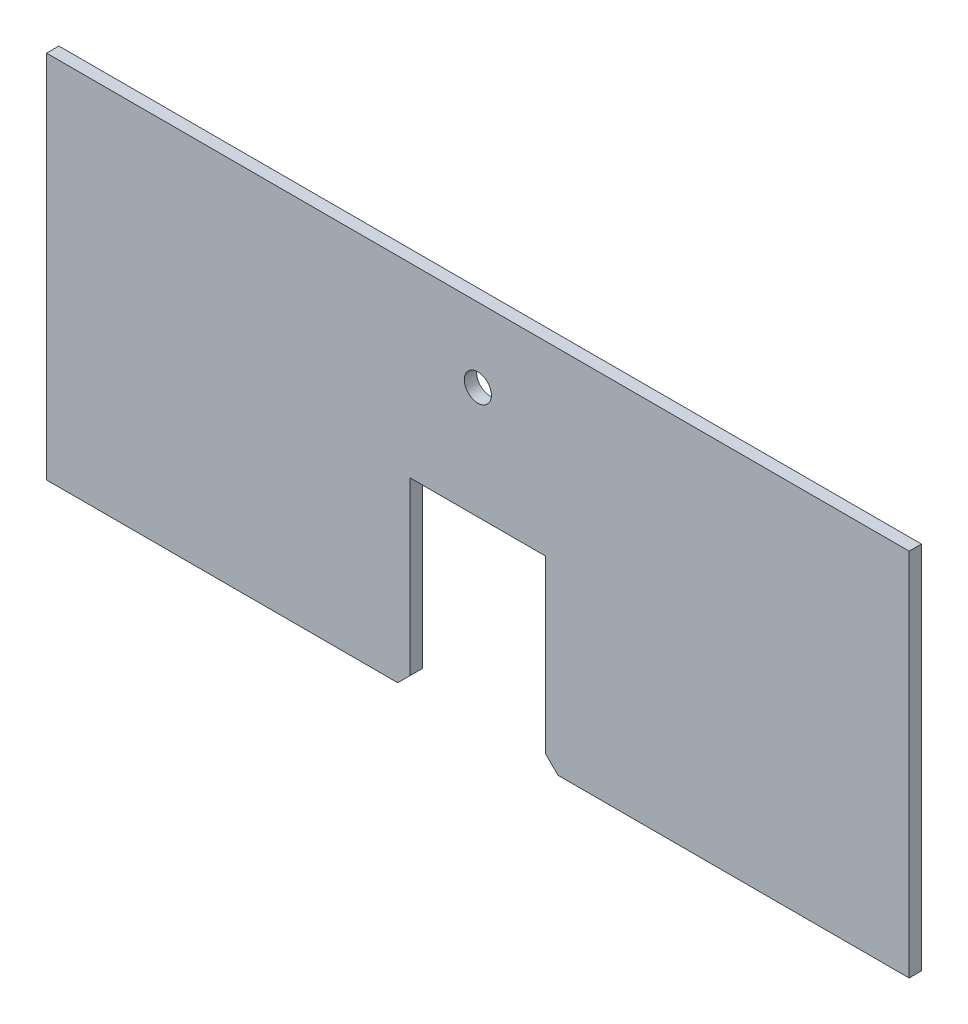
ISO-10303-21;
HEADER;
FILE_DESCRIPTION(('STEP AP214'),'2;1');
FILE_NAME('part.step','',(''),(''),'','','');
FILE_SCHEMA(('AUTOMOTIVE_DESIGN { 1 0 10303 214 1 1 1 1 }'));
ENDSEC;
DATA;
#1=APPLICATION_CONTEXT('core data for automotive mechanical design processes');
#2=APPLICATION_PROTOCOL_DEFINITION('international standard','automotive_design',2000,#1);
#3=PRODUCT_CONTEXT('',#1,'mechanical');
#4=PRODUCT('Part','Part','',(#3));
#5=PRODUCT_RELATED_PRODUCT_CATEGORY('part','',(#4));
#6=PRODUCT_DEFINITION_FORMATION('','',#4);
#7=PRODUCT_DEFINITION_CONTEXT('part definition',#1,'design');
#8=PRODUCT_DEFINITION('design','',#6,#7);
#9=PRODUCT_DEFINITION_SHAPE('','',#8);
#10=(LENGTH_UNIT() NAMED_UNIT(*) SI_UNIT(.MILLI.,.METRE.));
#11=(NAMED_UNIT(*) PLANE_ANGLE_UNIT() SI_UNIT($,.RADIAN.));
#12=(NAMED_UNIT(*) SI_UNIT($,.STERADIAN.) SOLID_ANGLE_UNIT());
#13=UNCERTAINTY_MEASURE_WITH_UNIT(LENGTH_MEASURE(1.E-05),#10,'distance_accuracy_value','');
#14=(GEOMETRIC_REPRESENTATION_CONTEXT(3) GLOBAL_UNCERTAINTY_ASSIGNED_CONTEXT((#13)) GLOBAL_UNIT_ASSIGNED_CONTEXT((#10,
#11,#12)) REPRESENTATION_CONTEXT('',''));
#15=CARTESIAN_POINT('',(0.,0.,0.));
#16=DIRECTION('',(0.,0.,1.));
#17=DIRECTION('',(1.,0.,0.));
#18=AXIS2_PLACEMENT_3D('',#15,#16,#17);
#19=CARTESIAN_POINT('',(-350.,232.421392473446,5.));
#20=DIRECTION('',(1.,0.,0.));
#21=DIRECTION('',(0.,1.,0.));
#22=AXIS2_PLACEMENT_3D('',#19,#20,#21);
#23=PLANE('',#22);
#24=DIRECTION('',(0.,-1.,0.));
#25=VECTOR('',#24,1.);
#26=CARTESIAN_POINT('',(-350.,232.421392473446,-5.));
#27=LINE('',#26,#25);
#28=CARTESIAN_POINT('',(-350.,232.421392473446,-5.));
#29=VERTEX_POINT('',#28);
#30=CARTESIAN_POINT('',(-350.,-67.5786075265541,-5.));
#31=VERTEX_POINT('',#30);
#32=EDGE_CURVE('E141',#29,#31,#27,.T.);
#33=ORIENTED_EDGE('',*,*,#32,.T.);
#34=DIRECTION('',(0.,0.,-1.));
#35=VECTOR('',#34,1.);
#36=CARTESIAN_POINT('',(-350.,-67.5786075265541,5.));
#37=LINE('',#36,#35);
#38=CARTESIAN_POINT('',(-350.,-67.5786075265541,5.));
#39=VERTEX_POINT('',#38);
#40=EDGE_CURVE('E11',#39,#31,#37,.T.);
#41=ORIENTED_EDGE('',*,*,#40,.F.);
#42=DIRECTION('',(0.,-1.,0.));
#43=VECTOR('',#42,1.);
#44=CARTESIAN_POINT('',(-350.,232.421392473446,5.));
#45=LINE('',#44,#43);
#46=CARTESIAN_POINT('',(-350.,232.421392473446,5.));
#47=VERTEX_POINT('',#46);
#48=EDGE_CURVE('E160',#47,#39,#45,.T.);
#49=ORIENTED_EDGE('',*,*,#48,.F.);
#50=DIRECTION('',(0.,0.,-1.));
#51=VECTOR('',#50,1.);
#52=CARTESIAN_POINT('',(-350.,232.421392473446,5.));
#53=LINE('',#52,#51);
#54=EDGE_CURVE('E137',#47,#29,#53,.T.);
#55=ORIENTED_EDGE('',*,*,#54,.T.);
#56=EDGE_LOOP('',(#33,#41,#49,#55));
#57=FACE_BOUND('',#56,.T.);
#58=ADVANCED_FACE('F33',(#57),#23,.F.);
#59=CARTESIAN_POINT('',(-350.,-67.5786075265541,5.));
#60=DIRECTION('',(0.,1.,0.));
#61=DIRECTION('',(-1.,0.,0.));
#62=AXIS2_PLACEMENT_3D('',#59,#60,#61);
#63=PLANE('',#62);
#64=DIRECTION('',(1.,0.,0.));
#65=VECTOR('',#64,1.);
#66=CARTESIAN_POINT('',(-350.,-67.5786075265541,-5.));
#67=LINE('',#66,#65);
#68=CARTESIAN_POINT('',(-65.,-67.5786075265541,-5.));
#69=VERTEX_POINT('',#68);
#70=EDGE_CURVE('E144',#31,#69,#67,.T.);
#71=ORIENTED_EDGE('',*,*,#70,.T.);
#72=DIRECTION('',(0.,0.,-1.));
#73=VECTOR('',#72,1.);
#74=CARTESIAN_POINT('',(-65.,-67.5786075265541,5.));
#75=LINE('',#74,#73);
#76=CARTESIAN_POINT('',(-65.,-67.5786075265541,5.));
#77=VERTEX_POINT('',#76);
#78=EDGE_CURVE('E41',#77,#69,#75,.T.);
#79=ORIENTED_EDGE('',*,*,#78,.F.);
#80=DIRECTION('',(1.,0.,0.));
#81=VECTOR('',#80,1.);
#82=CARTESIAN_POINT('',(-350.,-67.5786075265541,5.));
#83=LINE('',#82,#81);
#84=EDGE_CURVE('E98',#39,#77,#83,.T.);
#85=ORIENTED_EDGE('',*,*,#84,.F.);
#86=ORIENTED_EDGE('',*,*,#40,.T.);
#87=EDGE_LOOP('',(#71,#79,#85,#86));
#88=FACE_BOUND('',#87,.T.);
#89=ADVANCED_FACE('F227',(#88),#63,.F.);
#90=CARTESIAN_POINT('',(-65.,-67.5786075265541,5.));
#91=DIRECTION('',(-0.707106781186546,0.707106781186549,0.));
#92=DIRECTION('',(-0.707106781186549,-0.707106781186546,0.));
#93=AXIS2_PLACEMENT_3D('',#90,#91,#92);
#94=PLANE('',#93);
#95=DIRECTION('',(0.707106781186549,0.707106781186546,0.));
#96=VECTOR('',#95,1.);
#97=CARTESIAN_POINT('',(-65.,-67.5786075265541,-5.));
#98=LINE('',#97,#96);
#99=CARTESIAN_POINT('',(-55.,-57.5786075265541,-5.));
#100=VERTEX_POINT('',#99);
#101=EDGE_CURVE('E147',#69,#100,#98,.T.);
#102=ORIENTED_EDGE('',*,*,#101,.T.);
#103=DIRECTION('',(0.,0.,-1.));
#104=VECTOR('',#103,1.);
#105=CARTESIAN_POINT('',(-55.,-57.5786075265541,5.));
#106=LINE('',#105,#104);
#107=CARTESIAN_POINT('',(-55.,-57.5786075265541,5.));
#108=VERTEX_POINT('',#107);
#109=EDGE_CURVE('E173',#108,#100,#106,.T.);
#110=ORIENTED_EDGE('',*,*,#109,.F.);
#111=DIRECTION('',(0.707106781186549,0.707106781186546,0.));
#112=VECTOR('',#111,1.);
#113=CARTESIAN_POINT('',(-65.,-67.5786075265541,5.));
#114=LINE('',#113,#112);
#115=EDGE_CURVE('E181',#77,#108,#114,.T.);
#116=ORIENTED_EDGE('',*,*,#115,.F.);
#117=ORIENTED_EDGE('',*,*,#78,.T.);
#118=EDGE_LOOP('',(#102,#110,#116,#117));
#119=FACE_BOUND('',#118,.T.);
#120=ADVANCED_FACE('F179',(#119),#94,.F.);
#121=CARTESIAN_POINT('',(-55.,-57.5786075265541,5.));
#122=DIRECTION('',(-1.,0.,0.));
#123=DIRECTION('',(0.,0.,1.));
#124=AXIS2_PLACEMENT_3D('',#121,#122,#123);
#125=PLANE('',#124);
#126=DIRECTION('',(0.,1.,0.));
#127=VECTOR('',#126,1.);
#128=CARTESIAN_POINT('',(-55.,-57.5786075265541,-5.));
#129=LINE('',#128,#127);
#130=CARTESIAN_POINT('',(-55.,81.4213924734459,-5.));
#131=VERTEX_POINT('',#130);
#132=EDGE_CURVE('E149',#100,#131,#129,.T.);
#133=ORIENTED_EDGE('',*,*,#132,.T.);
#134=DIRECTION('',(0.,0.,-1.));
#135=VECTOR('',#134,1.);
#136=CARTESIAN_POINT('',(-55.,81.4213924734459,5.));
#137=LINE('',#136,#135);
#138=CARTESIAN_POINT('',(-55.,81.4213924734459,5.));
#139=VERTEX_POINT('',#138);
#140=EDGE_CURVE('E170',#139,#131,#137,.T.);
#141=ORIENTED_EDGE('',*,*,#140,.F.);
#142=DIRECTION('',(0.,1.,0.));
#143=VECTOR('',#142,1.);
#144=CARTESIAN_POINT('',(-55.,-57.5786075265541,5.));
#145=LINE('',#144,#143);
#146=EDGE_CURVE('E199',#108,#139,#145,.T.);
#147=ORIENTED_EDGE('',*,*,#146,.F.);
#148=ORIENTED_EDGE('',*,*,#109,.T.);
#149=EDGE_LOOP('',(#133,#141,#147,#148));
#150=FACE_BOUND('',#149,.T.);
#151=ADVANCED_FACE('F190',(#150),#125,.F.);
#152=CARTESIAN_POINT('',(-55.,81.4213924734459,5.));
#153=DIRECTION('',(0.,1.,0.));
#154=DIRECTION('',(0.,0.,1.));
#155=AXIS2_PLACEMENT_3D('',#152,#153,#154);
#156=PLANE('',#155);
#157=DIRECTION('',(1.,0.,0.));
#158=VECTOR('',#157,1.);
#159=CARTESIAN_POINT('',(-55.,81.4213924734459,-5.));
#160=LINE('',#159,#158);
#161=CARTESIAN_POINT('',(55.,81.4213924734459,-5.));
#162=VERTEX_POINT('',#161);
#163=EDGE_CURVE('E151',#131,#162,#160,.T.);
#164=ORIENTED_EDGE('',*,*,#163,.T.);
#165=DIRECTION('',(0.,0.,-1.));
#166=VECTOR('',#165,1.);
#167=CARTESIAN_POINT('',(55.,81.4213924734459,5.));
#168=LINE('',#167,#166);
#169=CARTESIAN_POINT('',(55.,81.4213924734459,5.));
#170=VERTEX_POINT('',#169);
#171=EDGE_CURVE('E167',#170,#162,#168,.T.);
#172=ORIENTED_EDGE('',*,*,#171,.F.);
#173=DIRECTION('',(1.,0.,0.));
#174=VECTOR('',#173,1.);
#175=CARTESIAN_POINT('',(-55.,81.4213924734459,5.));
#176=LINE('',#175,#174);
#177=EDGE_CURVE('E196',#139,#170,#176,.T.);
#178=ORIENTED_EDGE('',*,*,#177,.F.);
#179=ORIENTED_EDGE('',*,*,#140,.T.);
#180=EDGE_LOOP('',(#164,#172,#178,#179));
#181=FACE_BOUND('',#180,.T.);
#182=ADVANCED_FACE('F194',(#181),#156,.F.);
#183=CARTESIAN_POINT('',(55.,-57.5786075265541,5.));
#184=DIRECTION('',(1.,0.,0.));
#185=DIRECTION('',(0.,1.,0.));
#186=AXIS2_PLACEMENT_3D('',#183,#184,#185);
#187=PLANE('',#186);
#188=DIRECTION('',(0.,-1.,0.));
#189=VECTOR('',#188,1.);
#190=CARTESIAN_POINT('',(55.,-57.5786075265541,-5.));
#191=LINE('',#190,#189);
#192=CARTESIAN_POINT('',(55.,-57.5786075265541,-5.));
#193=VERTEX_POINT('',#192);
#194=EDGE_CURVE('E153',#162,#193,#191,.T.);
#195=ORIENTED_EDGE('',*,*,#194,.T.);
#196=DIRECTION('',(0.,0.,-1.));
#197=VECTOR('',#196,1.);
#198=CARTESIAN_POINT('',(55.,-57.5786075265541,5.));
#199=LINE('',#198,#197);
#200=CARTESIAN_POINT('',(55.,-57.5786075265541,5.));
#201=VERTEX_POINT('',#200);
#202=EDGE_CURVE('E164',#201,#193,#199,.T.);
#203=ORIENTED_EDGE('',*,*,#202,.F.);
#204=DIRECTION('',(0.,-1.,0.));
#205=VECTOR('',#204,1.);
#206=CARTESIAN_POINT('',(55.,-57.5786075265541,5.));
#207=LINE('',#206,#205);
#208=EDGE_CURVE('E198',#170,#201,#207,.T.);
#209=ORIENTED_EDGE('',*,*,#208,.F.);
#210=ORIENTED_EDGE('',*,*,#171,.T.);
#211=EDGE_LOOP('',(#195,#203,#209,#210));
#212=FACE_BOUND('',#211,.T.);
#213=ADVANCED_FACE('F239',(#212),#187,.F.);
#214=CARTESIAN_POINT('',(65.,-67.5786075265541,5.));
#215=DIRECTION('',(0.707106781186546,0.707106781186549,0.));
#216=DIRECTION('',(-0.707106781186549,0.707106781186546,0.));
#217=AXIS2_PLACEMENT_3D('',#214,#215,#216);
#218=PLANE('',#217);
#219=DIRECTION('',(0.707106781186549,-0.707106781186546,0.));
#220=VECTOR('',#219,1.);
#221=CARTESIAN_POINT('',(65.,-67.5786075265541,-5.));
#222=LINE('',#221,#220);
#223=CARTESIAN_POINT('',(65.,-67.5786075265541,-5.));
#224=VERTEX_POINT('',#223);
#225=EDGE_CURVE('E155',#193,#224,#222,.T.);
#226=ORIENTED_EDGE('',*,*,#225,.T.);
#227=DIRECTION('',(0.,0.,-1.));
#228=VECTOR('',#227,1.);
#229=CARTESIAN_POINT('',(65.,-67.5786075265541,5.));
#230=LINE('',#229,#228);
#231=CARTESIAN_POINT('',(65.,-67.5786075265541,5.));
#232=VERTEX_POINT('',#231);
#233=EDGE_CURVE('E132',#232,#224,#230,.T.);
#234=ORIENTED_EDGE('',*,*,#233,.F.);
#235=DIRECTION('',(0.707106781186549,-0.707106781186546,0.));
#236=VECTOR('',#235,1.);
#237=CARTESIAN_POINT('',(65.,-67.5786075265541,5.));
#238=LINE('',#237,#236);
#239=EDGE_CURVE('E123',#201,#232,#238,.T.);
#240=ORIENTED_EDGE('',*,*,#239,.F.);
#241=ORIENTED_EDGE('',*,*,#202,.T.);
#242=EDGE_LOOP('',(#226,#234,#240,#241));
#243=FACE_BOUND('',#242,.T.);
#244=ADVANCED_FACE('F236',(#243),#218,.F.);
#245=CARTESIAN_POINT('',(350.,-67.5786075265541,5.));
#246=DIRECTION('',(0.,1.,0.));
#247=DIRECTION('',(0.,0.,1.));
#248=AXIS2_PLACEMENT_3D('',#245,#246,#247);
#249=PLANE('',#248);
#250=DIRECTION('',(1.,0.,0.));
#251=VECTOR('',#250,1.);
#252=CARTESIAN_POINT('',(350.,-67.5786075265541,-5.));
#253=LINE('',#252,#251);
#254=CARTESIAN_POINT('',(350.,-67.5786075265541,-5.));
#255=VERTEX_POINT('',#254);
#256=EDGE_CURVE('E131',#224,#255,#253,.T.);
#257=ORIENTED_EDGE('',*,*,#256,.T.);
#258=DIRECTION('',(0.,0.,-1.));
#259=VECTOR('',#258,1.);
#260=CARTESIAN_POINT('',(350.,-67.5786075265541,5.));
#261=LINE('',#260,#259);
#262=CARTESIAN_POINT('',(350.,-67.5786075265541,5.));
#263=VERTEX_POINT('',#262);
#264=EDGE_CURVE('E128',#263,#255,#261,.T.);
#265=ORIENTED_EDGE('',*,*,#264,.F.);
#266=DIRECTION('',(1.,0.,0.));
#267=VECTOR('',#266,1.);
#268=CARTESIAN_POINT('',(350.,-67.5786075265541,5.));
#269=LINE('',#268,#267);
#270=EDGE_CURVE('E117',#232,#263,#269,.T.);
#271=ORIENTED_EDGE('',*,*,#270,.F.);
#272=ORIENTED_EDGE('',*,*,#233,.T.);
#273=EDGE_LOOP('',(#257,#265,#271,#272));
#274=FACE_BOUND('',#273,.T.);
#275=ADVANCED_FACE('F129',(#274),#249,.F.);
#276=CARTESIAN_POINT('',(350.,232.421392473446,5.));
#277=DIRECTION('',(-1.,0.,0.));
#278=DIRECTION('',(0.,-1.,0.));
#279=AXIS2_PLACEMENT_3D('',#276,#277,#278);
#280=PLANE('',#279);
#281=DIRECTION('',(0.,1.,0.));
#282=VECTOR('',#281,1.);
#283=CARTESIAN_POINT('',(350.,232.421392473446,-5.));
#284=LINE('',#283,#282);
#285=CARTESIAN_POINT('',(350.,232.421392473446,-5.));
#286=VERTEX_POINT('',#285);
#287=EDGE_CURVE('E84',#255,#286,#284,.T.);
#288=ORIENTED_EDGE('',*,*,#287,.T.);
#289=DIRECTION('',(0.,0.,-1.));
#290=VECTOR('',#289,1.);
#291=CARTESIAN_POINT('',(350.,232.421392473446,5.));
#292=LINE('',#291,#290);
#293=CARTESIAN_POINT('',(350.,232.421392473446,5.));
#294=VERTEX_POINT('',#293);
#295=EDGE_CURVE('E133',#294,#286,#292,.T.);
#296=ORIENTED_EDGE('',*,*,#295,.F.);
#297=DIRECTION('',(0.,1.,0.));
#298=VECTOR('',#297,1.);
#299=CARTESIAN_POINT('',(350.,232.421392473446,5.));
#300=LINE('',#299,#298);
#301=EDGE_CURVE('E121',#263,#294,#300,.T.);
#302=ORIENTED_EDGE('',*,*,#301,.F.);
#303=ORIENTED_EDGE('',*,*,#264,.T.);
#304=EDGE_LOOP('',(#288,#296,#302,#303));
#305=FACE_BOUND('',#304,.T.);
#306=ADVANCED_FACE('F135',(#305),#280,.F.);
#307=CARTESIAN_POINT('',(350.,232.421392473446,5.));
#308=DIRECTION('',(0.,-1.,0.));
#309=DIRECTION('',(0.,0.,-1.));
#310=AXIS2_PLACEMENT_3D('',#307,#308,#309);
#311=PLANE('',#310);
#312=DIRECTION('',(-1.,0.,0.));
#313=VECTOR('',#312,1.);
#314=CARTESIAN_POINT('',(350.,232.421392473446,-5.));
#315=LINE('',#314,#313);
#316=EDGE_CURVE('E90',#286,#29,#315,.T.);
#317=ORIENTED_EDGE('',*,*,#316,.T.);
#318=ORIENTED_EDGE('',*,*,#54,.F.);
#319=DIRECTION('',(-1.,0.,0.));
#320=VECTOR('',#319,1.);
#321=CARTESIAN_POINT('',(350.,232.421392473446,5.));
#322=LINE('',#321,#320);
#323=EDGE_CURVE('E49',#294,#47,#322,.T.);
#324=ORIENTED_EDGE('',*,*,#323,.F.);
#325=ORIENTED_EDGE('',*,*,#295,.T.);
#326=EDGE_LOOP('',(#317,#318,#324,#325));
#327=FACE_BOUND('',#326,.T.);
#328=ADVANCED_FACE('F216',(#327),#311,.F.);
#329=CARTESIAN_POINT('',(0.,0.,5.));
#330=DIRECTION('',(0.,0.,1.));
#331=DIRECTION('',(1.,0.,0.));
#332=AXIS2_PLACEMENT_3D('',#329,#330,#331);
#333=PLANE('',#332);
#334=CARTESIAN_POINT('',(0.,172.421392473446,5.));
#335=DIRECTION('',(0.,0.,1.));
#336=DIRECTION('',(1.,0.,0.));
#337=AXIS2_PLACEMENT_3D('',#334,#335,#336);
#338=CIRCLE('',#337,11.);
#339=CARTESIAN_POINT('',(11.,172.421392473446,5.));
#340=VERTEX_POINT('',#339);
#341=EDGE_CURVE('E209',#340,#340,#338,.T.);
#342=ORIENTED_EDGE('',*,*,#341,.F.);
#343=EDGE_LOOP('',(#342));
#344=FACE_BOUND('',#343,.T.);
#345=ORIENTED_EDGE('',*,*,#48,.T.);
#346=ORIENTED_EDGE('',*,*,#84,.T.);
#347=ORIENTED_EDGE('',*,*,#115,.T.);
#348=ORIENTED_EDGE('',*,*,#146,.T.);
#349=ORIENTED_EDGE('',*,*,#177,.T.);
#350=ORIENTED_EDGE('',*,*,#208,.T.);
#351=ORIENTED_EDGE('',*,*,#239,.T.);
#352=ORIENTED_EDGE('',*,*,#270,.T.);
#353=ORIENTED_EDGE('',*,*,#301,.T.);
#354=ORIENTED_EDGE('',*,*,#323,.T.);
#355=EDGE_LOOP('',(#345,#346,#347,#348,#349,#350,#351,#352,#353,#354));
#356=FACE_BOUND('',#355,.T.);
#357=ADVANCED_FACE('F119',(#344,#356),#333,.T.);
#358=CARTESIAN_POINT('',(0.,0.,-5.));
#359=DIRECTION('',(0.,0.,1.));
#360=DIRECTION('',(1.,0.,0.));
#361=AXIS2_PLACEMENT_3D('',#358,#359,#360);
#362=PLANE('',#361);
#363=CARTESIAN_POINT('',(0.,172.421392473446,-5.));
#364=DIRECTION('',(0.,0.,1.));
#365=DIRECTION('',(1.,0.,0.));
#366=AXIS2_PLACEMENT_3D('',#363,#364,#365);
#367=CIRCLE('',#366,11.);
#368=CARTESIAN_POINT('',(11.,172.421392473446,-5.));
#369=VERTEX_POINT('',#368);
#370=EDGE_CURVE('E145',#369,#369,#367,.T.);
#371=ORIENTED_EDGE('',*,*,#370,.T.);
#372=EDGE_LOOP('',(#371));
#373=FACE_BOUND('',#372,.T.);
#374=ORIENTED_EDGE('',*,*,#32,.F.);
#375=ORIENTED_EDGE('',*,*,#316,.F.);
#376=ORIENTED_EDGE('',*,*,#287,.F.);
#377=ORIENTED_EDGE('',*,*,#256,.F.);
#378=ORIENTED_EDGE('',*,*,#225,.F.);
#379=ORIENTED_EDGE('',*,*,#194,.F.);
#380=ORIENTED_EDGE('',*,*,#163,.F.);
#381=ORIENTED_EDGE('',*,*,#132,.F.);
#382=ORIENTED_EDGE('',*,*,#101,.F.);
#383=ORIENTED_EDGE('',*,*,#70,.F.);
#384=EDGE_LOOP('',(#374,#375,#376,#377,#378,#379,#380,#381,#382,#383));
#385=FACE_BOUND('',#384,.T.);
#386=ADVANCED_FACE('F185',(#373,#385),#362,.F.);
#387=CARTESIAN_POINT('',(0.,172.421392473446,-5.));
#388=DIRECTION('',(0.,0.,1.));
#389=DIRECTION('',(1.,0.,0.));
#390=AXIS2_PLACEMENT_3D('',#387,#388,#389);
#391=CYLINDRICAL_SURFACE('',#390,11.);
#392=ORIENTED_EDGE('',*,*,#370,.F.);
#393=EDGE_LOOP('',(#392));
#394=FACE_BOUND('',#393,.T.);
#395=ORIENTED_EDGE('',*,*,#341,.T.);
#396=EDGE_LOOP('',(#395));
#397=FACE_BOUND('',#396,.T.);
#398=ADVANCED_FACE('F213',(#394,#397),#391,.F.);
#399=CLOSED_SHELL('',(#58,#89,#120,#151,#182,#213,#244,#275,#306,#328,#357,#386,#398));
#400=MANIFOLD_SOLID_BREP('B2',#399);
#401=ADVANCED_BREP_SHAPE_REPRESENTATION('',(#18,#400),#14);
#402=SHAPE_DEFINITION_REPRESENTATION(#9,#401);
ENDSEC;
END-ISO-10303-21;
